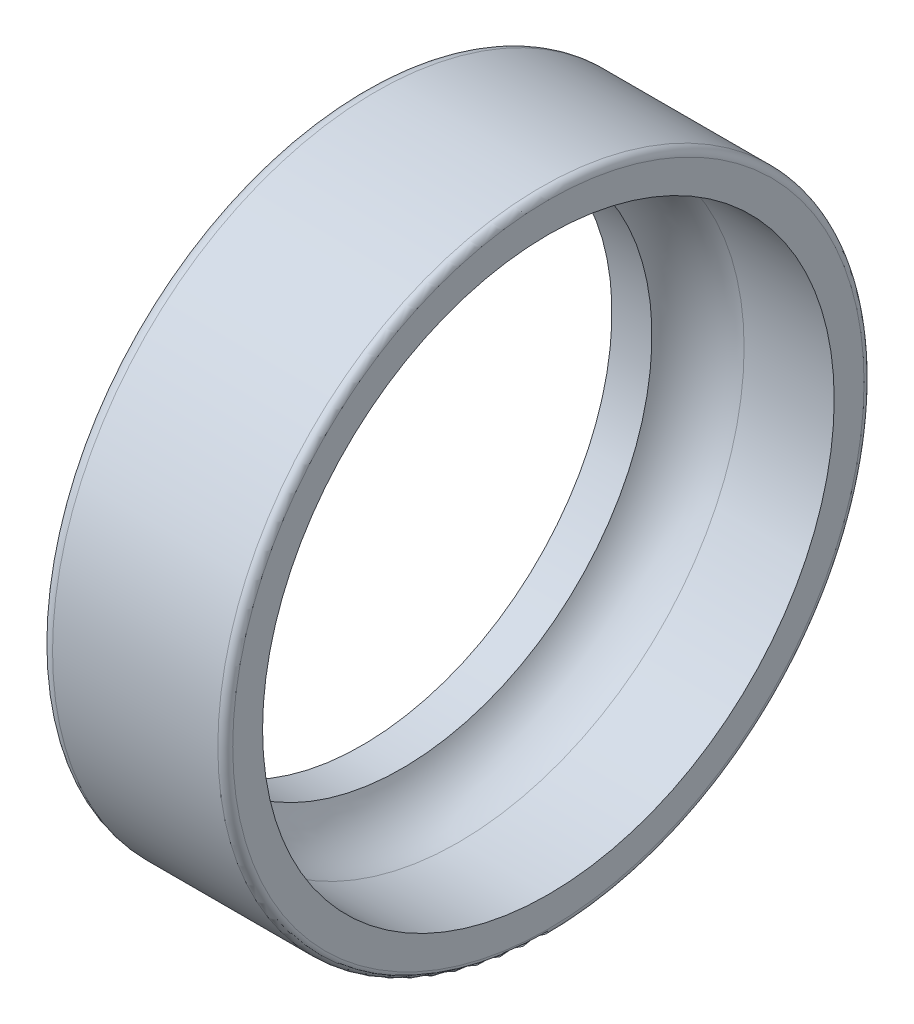
ISO-10303-21;
HEADER;
FILE_DESCRIPTION(('STEP AP214'),'2;1');
FILE_NAME('part.step','',(''),(''),'','','');
FILE_SCHEMA(('AUTOMOTIVE_DESIGN { 1 0 10303 214 1 1 1 1 }'));
ENDSEC;
DATA;
#1=APPLICATION_CONTEXT('core data for automotive mechanical design processes');
#2=APPLICATION_PROTOCOL_DEFINITION('international standard','automotive_design',2000,#1);
#3=PRODUCT_CONTEXT('',#1,'mechanical');
#4=PRODUCT('Part','Part','',(#3));
#5=PRODUCT_RELATED_PRODUCT_CATEGORY('part','',(#4));
#6=PRODUCT_DEFINITION_FORMATION('','',#4);
#7=PRODUCT_DEFINITION_CONTEXT('part definition',#1,'design');
#8=PRODUCT_DEFINITION('design','',#6,#7);
#9=PRODUCT_DEFINITION_SHAPE('','',#8);
#10=(LENGTH_UNIT() NAMED_UNIT(*) SI_UNIT(.MILLI.,.METRE.));
#11=(NAMED_UNIT(*) PLANE_ANGLE_UNIT() SI_UNIT($,.RADIAN.));
#12=(NAMED_UNIT(*) SI_UNIT($,.STERADIAN.) SOLID_ANGLE_UNIT());
#13=UNCERTAINTY_MEASURE_WITH_UNIT(LENGTH_MEASURE(1.E-05),#10,'distance_accuracy_value','');
#14=(GEOMETRIC_REPRESENTATION_CONTEXT(3) GLOBAL_UNCERTAINTY_ASSIGNED_CONTEXT((#13)) GLOBAL_UNIT_ASSIGNED_CONTEXT((#10,
#11,#12)) REPRESENTATION_CONTEXT('',''));
#15=CARTESIAN_POINT('',(0.,0.,0.));
#16=DIRECTION('',(0.,0.,1.));
#17=DIRECTION('',(1.,0.,0.));
#18=AXIS2_PLACEMENT_3D('',#15,#16,#17);
#19=CARTESIAN_POINT('',(1.1,0.,0.));
#20=DIRECTION('',(-1.,0.,0.));
#21=DIRECTION('',(0.,0.,1.));
#22=AXIS2_PLACEMENT_3D('',#19,#20,#21);
#23=CYLINDRICAL_SURFACE('',#22,23.);
#24=CARTESIAN_POINT('',(15.,0.,0.));
#25=DIRECTION('',(-1.,0.,0.));
#26=DIRECTION('',(0.,0.,1.));
#27=AXIS2_PLACEMENT_3D('',#24,#25,#26);
#28=CIRCLE('',#27,23.);
#29=CARTESIAN_POINT('',(15.,0.,23.));
#30=VERTEX_POINT('',#29);
#31=EDGE_CURVE('E10',#30,#30,#28,.T.);
#32=ORIENTED_EDGE('',*,*,#31,.F.);
#33=EDGE_LOOP('',(#32));
#34=FACE_BOUND('',#33,.T.);
#35=CARTESIAN_POINT('',(7.75,0.,0.));
#36=DIRECTION('',(-1.,0.,0.));
#37=DIRECTION('',(0.,0.,1.));
#38=AXIS2_PLACEMENT_3D('',#35,#36,#37);
#39=CIRCLE('',#38,23.);
#40=CARTESIAN_POINT('',(7.75,0.,23.));
#41=VERTEX_POINT('',#40);
#42=EDGE_CURVE('E56',#41,#41,#39,.T.);
#43=ORIENTED_EDGE('',*,*,#42,.T.);
#44=EDGE_LOOP('',(#43));
#45=FACE_BOUND('',#44,.T.);
#46=ADVANCED_FACE('F14',(#34,#45),#23,.F.);
#47=CARTESIAN_POINT('',(15.,25.4,0.));
#48=DIRECTION('',(1.,0.,0.));
#49=DIRECTION('',(0.,0.,-1.));
#50=AXIS2_PLACEMENT_3D('',#47,#48,#49);
#51=PLANE('',#50);
#52=ORIENTED_EDGE('',*,*,#31,.T.);
#53=EDGE_LOOP('',(#52));
#54=FACE_BOUND('',#53,.T.);
#55=CARTESIAN_POINT('',(15.,0.,0.));
#56=DIRECTION('',(-1.,0.,0.));
#57=DIRECTION('',(0.,0.,1.));
#58=AXIS2_PLACEMENT_3D('',#55,#56,#57);
#59=CIRCLE('',#58,25.4);
#60=CARTESIAN_POINT('',(15.,0.,25.4));
#61=VERTEX_POINT('',#60);
#62=EDGE_CURVE('E21',#61,#61,#59,.T.);
#63=ORIENTED_EDGE('',*,*,#62,.F.);
#64=EDGE_LOOP('',(#63));
#65=FACE_BOUND('',#64,.T.);
#66=ADVANCED_FACE('F75',(#54,#65),#51,.T.);
#67=CARTESIAN_POINT('',(14.4,0.,0.));
#68=DIRECTION('',(-1.,0.,0.));
#69=DIRECTION('',(0.,0.,1.));
#70=AXIS2_PLACEMENT_3D('',#67,#68,#69);
#71=TOROIDAL_SURFACE('',#70,25.4,0.6);
#72=CARTESIAN_POINT('',(14.4,0.,0.));
#73=DIRECTION('',(-1.,0.,0.));
#74=DIRECTION('',(0.,0.,1.));
#75=AXIS2_PLACEMENT_3D('',#72,#73,#74);
#76=CIRCLE('',#75,26.);
#77=CARTESIAN_POINT('',(14.4,0.,26.));
#78=VERTEX_POINT('',#77);
#79=EDGE_CURVE('E30',#78,#78,#76,.T.);
#80=ORIENTED_EDGE('',*,*,#79,.F.);
#81=EDGE_LOOP('',(#80));
#82=FACE_BOUND('',#81,.T.);
#83=ORIENTED_EDGE('',*,*,#62,.T.);
#84=EDGE_LOOP('',(#83));
#85=FACE_BOUND('',#84,.T.);
#86=ADVANCED_FACE('F80',(#82,#85),#71,.T.);
#87=CARTESIAN_POINT('',(1.1,0.,0.));
#88=DIRECTION('',(-1.,0.,0.));
#89=DIRECTION('',(0.,0.,1.));
#90=AXIS2_PLACEMENT_3D('',#87,#88,#89);
#91=CYLINDRICAL_SURFACE('',#90,26.);
#92=ORIENTED_EDGE('',*,*,#79,.T.);
#93=EDGE_LOOP('',(#92));
#94=FACE_BOUND('',#93,.T.);
#95=CARTESIAN_POINT('',(1.1,0.,0.));
#96=DIRECTION('',(-1.,0.,0.));
#97=DIRECTION('',(0.,0.,1.));
#98=AXIS2_PLACEMENT_3D('',#95,#96,#97);
#99=CIRCLE('',#98,26.);
#100=CARTESIAN_POINT('',(1.1,0.,26.));
#101=VERTEX_POINT('',#100);
#102=EDGE_CURVE('E38',#101,#101,#99,.T.);
#103=ORIENTED_EDGE('',*,*,#102,.F.);
#104=EDGE_LOOP('',(#103));
#105=FACE_BOUND('',#104,.T.);
#106=ADVANCED_FACE('F84',(#94,#105),#91,.T.);
#107=CARTESIAN_POINT('',(1.1,0.,0.));
#108=DIRECTION('',(-1.,0.,0.));
#109=DIRECTION('',(0.,0.,1.));
#110=AXIS2_PLACEMENT_3D('',#107,#108,#109);
#111=TOROIDAL_SURFACE('',#110,24.9,1.1);
#112=CARTESIAN_POINT('',(0.,0.,0.));
#113=DIRECTION('',(-1.,0.,0.));
#114=DIRECTION('',(0.,0.,1.));
#115=AXIS2_PLACEMENT_3D('',#112,#113,#114);
#116=CIRCLE('',#115,24.9);
#117=CARTESIAN_POINT('',(0.,0.,24.9));
#118=VERTEX_POINT('',#117);
#119=EDGE_CURVE('E44',#118,#118,#116,.T.);
#120=ORIENTED_EDGE('',*,*,#119,.F.);
#121=EDGE_LOOP('',(#120));
#122=FACE_BOUND('',#121,.T.);
#123=ORIENTED_EDGE('',*,*,#102,.T.);
#124=EDGE_LOOP('',(#123));
#125=FACE_BOUND('',#124,.T.);
#126=ADVANCED_FACE('F91',(#122,#125),#111,.T.);
#127=CARTESIAN_POINT('',(0.,20.1130913087035,0.));
#128=DIRECTION('',(-1.,0.,0.));
#129=DIRECTION('',(0.,0.,1.));
#130=AXIS2_PLACEMENT_3D('',#127,#128,#129);
#131=PLANE('',#130);
#132=ORIENTED_EDGE('',*,*,#119,.T.);
#133=EDGE_LOOP('',(#132));
#134=FACE_BOUND('',#133,.T.);
#135=CARTESIAN_POINT('',(0.,0.,0.));
#136=DIRECTION('',(-1.,0.,0.));
#137=DIRECTION('',(0.,0.,1.));
#138=AXIS2_PLACEMENT_3D('',#135,#136,#137);
#139=CIRCLE('',#138,20.1130913087035);
#140=CARTESIAN_POINT('',(0.,0.,20.1130913087035));
#141=VERTEX_POINT('',#140);
#142=EDGE_CURVE('E48',#141,#141,#139,.T.);
#143=ORIENTED_EDGE('',*,*,#142,.F.);
#144=EDGE_LOOP('',(#143));
#145=FACE_BOUND('',#144,.T.);
#146=ADVANCED_FACE('F71',(#134,#145),#131,.T.);
#147=CARTESIAN_POINT('',(1.1,0.,0.));
#148=DIRECTION('',(-1.,0.,0.));
#149=DIRECTION('',(0.,0.,1.));
#150=AXIS2_PLACEMENT_3D('',#147,#148,#149);
#151=CYLINDRICAL_SURFACE('',#150,20.1130913087035);
#152=ORIENTED_EDGE('',*,*,#142,.T.);
#153=EDGE_LOOP('',(#152));
#154=FACE_BOUND('',#153,.T.);
#155=CARTESIAN_POINT('',(3.21846106481675,0.,0.));
#156=DIRECTION('',(-1.,0.,0.));
#157=DIRECTION('',(0.,0.,1.));
#158=AXIS2_PLACEMENT_3D('',#155,#156,#157);
#159=CIRCLE('',#158,20.1130913087035);
#160=CARTESIAN_POINT('',(3.21846106481675,0.,20.1130913087035));
#161=VERTEX_POINT('',#160);
#162=EDGE_CURVE('E52',#161,#161,#159,.T.);
#163=ORIENTED_EDGE('',*,*,#162,.F.);
#164=EDGE_LOOP('',(#163));
#165=FACE_BOUND('',#164,.T.);
#166=ADVANCED_FACE('F64',(#154,#165),#151,.F.);
#167=CARTESIAN_POINT('',(7.75,0.,0.));
#168=DIRECTION('',(-1.,0.,0.));
#169=DIRECTION('',(0.,0.,1.));
#170=AXIS2_PLACEMENT_3D('',#167,#168,#169);
#171=TOROIDAL_SURFACE('',#170,18.,5.);
#172=ORIENTED_EDGE('',*,*,#162,.T.);
#173=EDGE_LOOP('',(#172));
#174=FACE_BOUND('',#173,.T.);
#175=ORIENTED_EDGE('',*,*,#42,.F.);
#176=EDGE_LOOP('',(#175));
#177=FACE_BOUND('',#176,.T.);
#178=ADVANCED_FACE('F62',(#174,#177),#171,.F.);
#179=CLOSED_SHELL('',(#46,#66,#86,#106,#126,#146,#166,#178));
#180=MANIFOLD_SOLID_BREP('B1',#179);
#181=ADVANCED_BREP_SHAPE_REPRESENTATION('',(#18,#180),#14);
#182=SHAPE_DEFINITION_REPRESENTATION(#9,#181);
ENDSEC;
END-ISO-10303-21;
